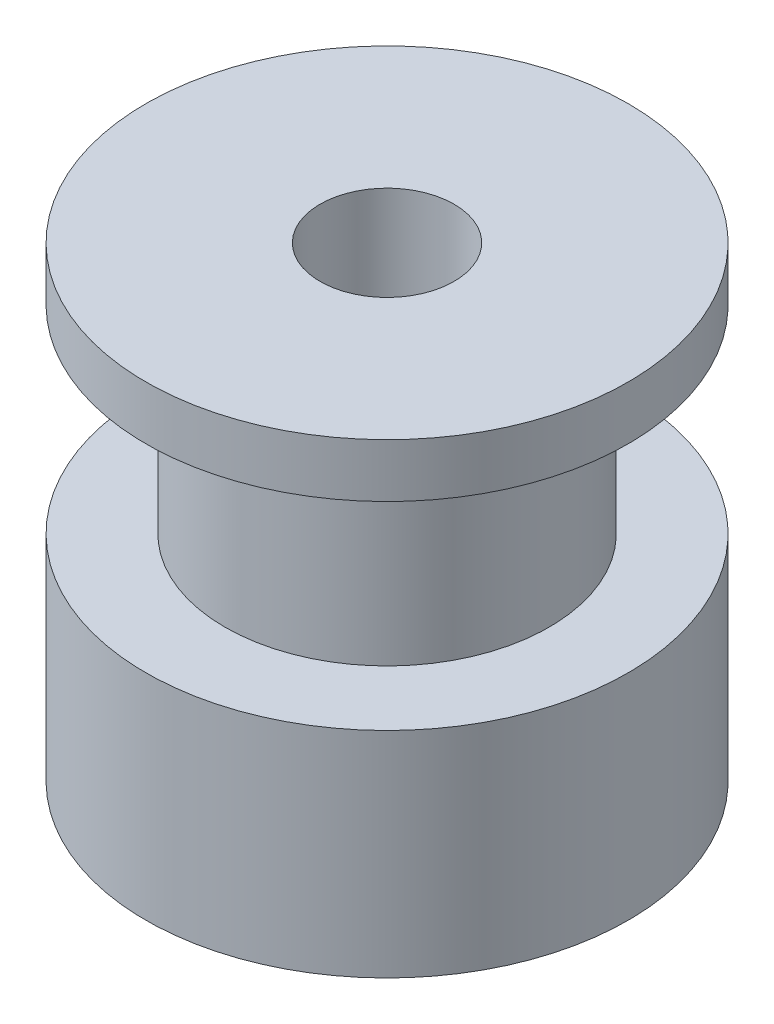
ISO-10303-21;
HEADER;
FILE_DESCRIPTION(('STEP AP214'),'2;1');
FILE_NAME('part.step','',(''),(''),'','','');
FILE_SCHEMA(('AUTOMOTIVE_DESIGN { 1 0 10303 214 1 1 1 1 }'));
ENDSEC;
DATA;
#1=APPLICATION_CONTEXT('core data for automotive mechanical design processes');
#2=APPLICATION_PROTOCOL_DEFINITION('international standard','automotive_design',2000,#1);
#3=PRODUCT_CONTEXT('',#1,'mechanical');
#4=PRODUCT('Part','Part','',(#3));
#5=PRODUCT_RELATED_PRODUCT_CATEGORY('part','',(#4));
#6=PRODUCT_DEFINITION_FORMATION('','',#4);
#7=PRODUCT_DEFINITION_CONTEXT('part definition',#1,'design');
#8=PRODUCT_DEFINITION('design','',#6,#7);
#9=PRODUCT_DEFINITION_SHAPE('','',#8);
#10=(LENGTH_UNIT() NAMED_UNIT(*) SI_UNIT(.MILLI.,.METRE.));
#11=(NAMED_UNIT(*) PLANE_ANGLE_UNIT() SI_UNIT($,.RADIAN.));
#12=(NAMED_UNIT(*) SI_UNIT($,.STERADIAN.) SOLID_ANGLE_UNIT());
#13=UNCERTAINTY_MEASURE_WITH_UNIT(LENGTH_MEASURE(1.E-05),#10,'distance_accuracy_value','');
#14=(GEOMETRIC_REPRESENTATION_CONTEXT(3) GLOBAL_UNCERTAINTY_ASSIGNED_CONTEXT((#13)) GLOBAL_UNIT_ASSIGNED_CONTEXT((#10,
#11,#12)) REPRESENTATION_CONTEXT('',''));
#15=CARTESIAN_POINT('',(0.,0.,0.));
#16=DIRECTION('',(0.,0.,1.));
#17=DIRECTION('',(1.,0.,0.));
#18=AXIS2_PLACEMENT_3D('',#15,#16,#17);
#19=CARTESIAN_POINT('',(-6.05,8.,0.));
#20=DIRECTION('',(0.,-1.,0.));
#21=DIRECTION('',(0.,0.,-1.));
#22=AXIS2_PLACEMENT_3D('',#19,#20,#21);
#23=PLANE('',#22);
#24=CARTESIAN_POINT('',(0.,8.,0.));
#25=DIRECTION('',(0.,-1.,0.));
#26=DIRECTION('',(0.,0.,-1.));
#27=AXIS2_PLACEMENT_3D('',#24,#25,#26);
#28=CIRCLE('',#27,9.);
#29=CARTESIAN_POINT('',(0.,8.,-9.));
#30=VERTEX_POINT('',#29);
#31=EDGE_CURVE('E10',#30,#30,#28,.T.);
#32=ORIENTED_EDGE('',*,*,#31,.F.);
#33=EDGE_LOOP('',(#32));
#34=FACE_BOUND('',#33,.T.);
#35=CARTESIAN_POINT('',(0.,8.,0.));
#36=DIRECTION('',(0.,-1.,0.));
#37=DIRECTION('',(0.,0.,-1.));
#38=AXIS2_PLACEMENT_3D('',#35,#36,#37);
#39=CIRCLE('',#38,6.05);
#40=CARTESIAN_POINT('',(0.,8.,-6.05));
#41=VERTEX_POINT('',#40);
#42=EDGE_CURVE('E63',#41,#41,#39,.T.);
#43=ORIENTED_EDGE('',*,*,#42,.T.);
#44=EDGE_LOOP('',(#43));
#45=FACE_BOUND('',#44,.T.);
#46=ADVANCED_FACE('F35',(#34,#45),#23,.F.);
#47=CARTESIAN_POINT('',(0.,0.,0.));
#48=DIRECTION('',(0.,-1.,0.));
#49=DIRECTION('',(0.,0.,-1.));
#50=AXIS2_PLACEMENT_3D('',#47,#48,#49);
#51=CYLINDRICAL_SURFACE('',#50,9.);
#52=CARTESIAN_POINT('',(0.,0.,0.));
#53=DIRECTION('',(0.,-1.,0.));
#54=DIRECTION('',(0.,0.,-1.));
#55=AXIS2_PLACEMENT_3D('',#52,#53,#54);
#56=CIRCLE('',#55,9.);
#57=CARTESIAN_POINT('',(0.,0.,-9.));
#58=VERTEX_POINT('',#57);
#59=EDGE_CURVE('E41',#58,#58,#56,.T.);
#60=ORIENTED_EDGE('',*,*,#59,.F.);
#61=EDGE_LOOP('',(#60));
#62=FACE_BOUND('',#61,.T.);
#63=ORIENTED_EDGE('',*,*,#31,.T.);
#64=EDGE_LOOP('',(#63));
#65=FACE_BOUND('',#64,.T.);
#66=ADVANCED_FACE('F100',(#62,#65),#51,.T.);
#67=CARTESIAN_POINT('',(-9.,0.,0.));
#68=DIRECTION('',(0.,1.,0.));
#69=DIRECTION('',(0.,0.,1.));
#70=AXIS2_PLACEMENT_3D('',#67,#68,#69);
#71=PLANE('',#70);
#72=CARTESIAN_POINT('',(0.,0.,0.));
#73=DIRECTION('',(0.,-1.,0.));
#74=DIRECTION('',(0.,0.,-1.));
#75=AXIS2_PLACEMENT_3D('',#72,#73,#74);
#76=CIRCLE('',#75,2.5);
#77=CARTESIAN_POINT('',(0.,0.,-2.5));
#78=VERTEX_POINT('',#77);
#79=EDGE_CURVE('E45',#78,#78,#76,.T.);
#80=ORIENTED_EDGE('',*,*,#79,.F.);
#81=EDGE_LOOP('',(#80));
#82=FACE_BOUND('',#81,.T.);
#83=ORIENTED_EDGE('',*,*,#59,.T.);
#84=EDGE_LOOP('',(#83));
#85=FACE_BOUND('',#84,.T.);
#86=ADVANCED_FACE('F95',(#82,#85),#71,.F.);
#87=CARTESIAN_POINT('',(0.,0.,0.));
#88=DIRECTION('',(0.,-1.,0.));
#89=DIRECTION('',(0.,0.,-1.));
#90=AXIS2_PLACEMENT_3D('',#87,#88,#89);
#91=CYLINDRICAL_SURFACE('',#90,2.5);
#92=CARTESIAN_POINT('',(0.,17.4,0.));
#93=DIRECTION('',(0.,-1.,0.));
#94=DIRECTION('',(0.,0.,-1.));
#95=AXIS2_PLACEMENT_3D('',#92,#93,#94);
#96=CIRCLE('',#95,2.5);
#97=CARTESIAN_POINT('',(0.,17.4,-2.5));
#98=VERTEX_POINT('',#97);
#99=EDGE_CURVE('E49',#98,#98,#96,.T.);
#100=ORIENTED_EDGE('',*,*,#99,.F.);
#101=EDGE_LOOP('',(#100));
#102=FACE_BOUND('',#101,.T.);
#103=ORIENTED_EDGE('',*,*,#79,.T.);
#104=EDGE_LOOP('',(#103));
#105=FACE_BOUND('',#104,.T.);
#106=ADVANCED_FACE('F89',(#102,#105),#91,.F.);
#107=CARTESIAN_POINT('',(-2.5,17.4,0.));
#108=DIRECTION('',(0.,-1.,0.));
#109=DIRECTION('',(0.,0.,-1.));
#110=AXIS2_PLACEMENT_3D('',#107,#108,#109);
#111=PLANE('',#110);
#112=CARTESIAN_POINT('',(0.,17.4,0.));
#113=DIRECTION('',(0.,-1.,0.));
#114=DIRECTION('',(0.,0.,-1.));
#115=AXIS2_PLACEMENT_3D('',#112,#113,#114);
#116=CIRCLE('',#115,9.);
#117=CARTESIAN_POINT('',(0.,17.4,-9.));
#118=VERTEX_POINT('',#117);
#119=EDGE_CURVE('E54',#118,#118,#116,.T.);
#120=ORIENTED_EDGE('',*,*,#119,.F.);
#121=EDGE_LOOP('',(#120));
#122=FACE_BOUND('',#121,.T.);
#123=ORIENTED_EDGE('',*,*,#99,.T.);
#124=EDGE_LOOP('',(#123));
#125=FACE_BOUND('',#124,.T.);
#126=ADVANCED_FACE('F83',(#122,#125),#111,.F.);
#127=CARTESIAN_POINT('',(0.,0.,0.));
#128=DIRECTION('',(0.,-1.,0.));
#129=DIRECTION('',(0.,0.,-1.));
#130=AXIS2_PLACEMENT_3D('',#127,#128,#129);
#131=CYLINDRICAL_SURFACE('',#130,9.);
#132=CARTESIAN_POINT('',(0.,15.4,0.));
#133=DIRECTION('',(0.,-1.,0.));
#134=DIRECTION('',(0.,0.,-1.));
#135=AXIS2_PLACEMENT_3D('',#132,#133,#134);
#136=CIRCLE('',#135,9.);
#137=CARTESIAN_POINT('',(0.,15.4,-9.));
#138=VERTEX_POINT('',#137);
#139=EDGE_CURVE('E57',#138,#138,#136,.T.);
#140=ORIENTED_EDGE('',*,*,#139,.F.);
#141=EDGE_LOOP('',(#140));
#142=FACE_BOUND('',#141,.T.);
#143=ORIENTED_EDGE('',*,*,#119,.T.);
#144=EDGE_LOOP('',(#143));
#145=FACE_BOUND('',#144,.T.);
#146=ADVANCED_FACE('F77',(#142,#145),#131,.T.);
#147=CARTESIAN_POINT('',(-9.,15.4,0.));
#148=DIRECTION('',(0.,1.,0.));
#149=DIRECTION('',(0.,0.,1.));
#150=AXIS2_PLACEMENT_3D('',#147,#148,#149);
#151=PLANE('',#150);
#152=CARTESIAN_POINT('',(0.,15.4,0.));
#153=DIRECTION('',(0.,-1.,0.));
#154=DIRECTION('',(0.,0.,-1.));
#155=AXIS2_PLACEMENT_3D('',#152,#153,#154);
#156=CIRCLE('',#155,6.05);
#157=CARTESIAN_POINT('',(0.,15.4,-6.05));
#158=VERTEX_POINT('',#157);
#159=EDGE_CURVE('E60',#158,#158,#156,.T.);
#160=ORIENTED_EDGE('',*,*,#159,.F.);
#161=EDGE_LOOP('',(#160));
#162=FACE_BOUND('',#161,.T.);
#163=ORIENTED_EDGE('',*,*,#139,.T.);
#164=EDGE_LOOP('',(#163));
#165=FACE_BOUND('',#164,.T.);
#166=ADVANCED_FACE('F71',(#162,#165),#151,.F.);
#167=CARTESIAN_POINT('',(0.,0.,0.));
#168=DIRECTION('',(0.,-1.,0.));
#169=DIRECTION('',(0.,0.,-1.));
#170=AXIS2_PLACEMENT_3D('',#167,#168,#169);
#171=CYLINDRICAL_SURFACE('',#170,6.05);
#172=ORIENTED_EDGE('',*,*,#42,.F.);
#173=EDGE_LOOP('',(#172));
#174=FACE_BOUND('',#173,.T.);
#175=ORIENTED_EDGE('',*,*,#159,.T.);
#176=EDGE_LOOP('',(#175));
#177=FACE_BOUND('',#176,.T.);
#178=ADVANCED_FACE('F68',(#174,#177),#171,.T.);
#179=CLOSED_SHELL('',(#46,#66,#86,#106,#126,#146,#166,#178));
#180=MANIFOLD_SOLID_BREP('B2',#179);
#181=ADVANCED_BREP_SHAPE_REPRESENTATION('',(#18,#180),#14);
#182=SHAPE_DEFINITION_REPRESENTATION(#9,#181);
ENDSEC;
END-ISO-10303-21;
